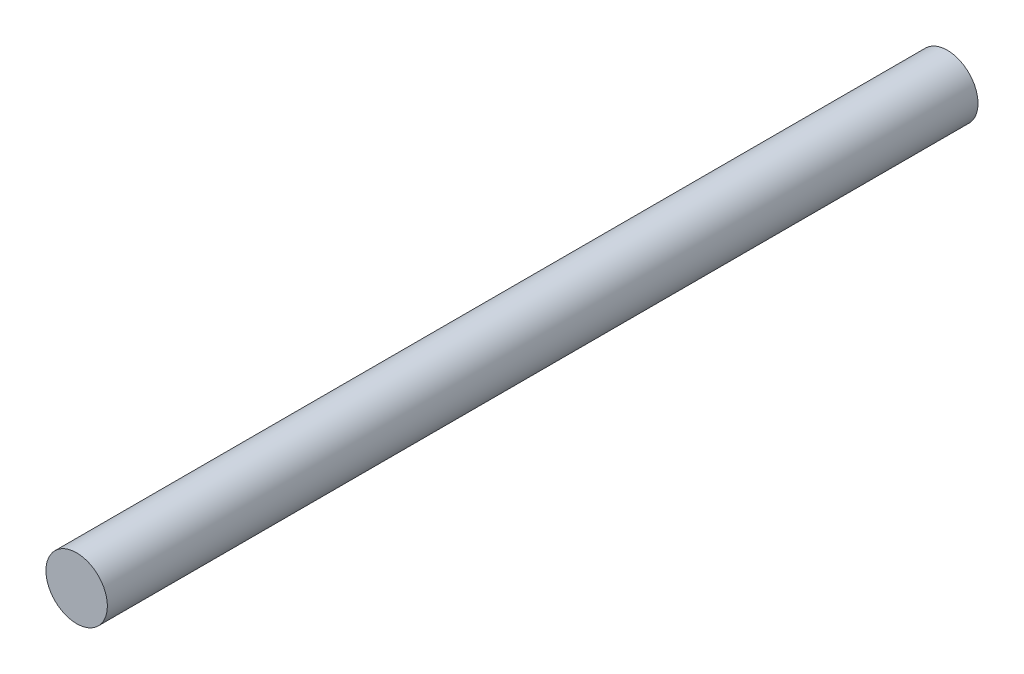
ISO-10303-21;
HEADER;
FILE_DESCRIPTION(('STEP AP214'),'2;1');
FILE_NAME('part.step','',(''),(''),'','','');
FILE_SCHEMA(('AUTOMOTIVE_DESIGN { 1 0 10303 214 1 1 1 1 }'));
ENDSEC;
DATA;
#1=APPLICATION_CONTEXT('core data for automotive mechanical design processes');
#2=APPLICATION_PROTOCOL_DEFINITION('international standard','automotive_design',2000,#1);
#3=PRODUCT_CONTEXT('',#1,'mechanical');
#4=PRODUCT('Part','Part','',(#3));
#5=PRODUCT_RELATED_PRODUCT_CATEGORY('part','',(#4));
#6=PRODUCT_DEFINITION_FORMATION('','',#4);
#7=PRODUCT_DEFINITION_CONTEXT('part definition',#1,'design');
#8=PRODUCT_DEFINITION('design','',#6,#7);
#9=PRODUCT_DEFINITION_SHAPE('','',#8);
#10=(LENGTH_UNIT() NAMED_UNIT(*) SI_UNIT(.MILLI.,.METRE.));
#11=(NAMED_UNIT(*) PLANE_ANGLE_UNIT() SI_UNIT($,.RADIAN.));
#12=(NAMED_UNIT(*) SI_UNIT($,.STERADIAN.) SOLID_ANGLE_UNIT());
#13=UNCERTAINTY_MEASURE_WITH_UNIT(LENGTH_MEASURE(1.E-05),#10,'distance_accuracy_value','');
#14=(GEOMETRIC_REPRESENTATION_CONTEXT(3) GLOBAL_UNCERTAINTY_ASSIGNED_CONTEXT((#13)) GLOBAL_UNIT_ASSIGNED_CONTEXT((#10,
#11,#12)) REPRESENTATION_CONTEXT('',''));
#15=CARTESIAN_POINT('',(0.,0.,0.));
#16=DIRECTION('',(0.,0.,1.));
#17=DIRECTION('',(1.,0.,0.));
#18=AXIS2_PLACEMENT_3D('',#15,#16,#17);
#19=CARTESIAN_POINT('',(0.,0.,-180.));
#20=DIRECTION('',(0.,0.,1.));
#21=DIRECTION('',(1.,0.,0.));
#22=AXIS2_PLACEMENT_3D('',#19,#20,#21);
#23=CYLINDRICAL_SURFACE('',#22,6.35);
#24=CARTESIAN_POINT('',(0.,0.,-180.));
#25=DIRECTION('',(0.,0.,1.));
#26=DIRECTION('',(1.,0.,0.));
#27=AXIS2_PLACEMENT_3D('',#24,#25,#26);
#28=CIRCLE('',#27,6.35);
#29=CARTESIAN_POINT('',(6.35,0.,-180.));
#30=VERTEX_POINT('',#29);
#31=EDGE_CURVE('E10',#30,#30,#28,.T.);
#32=ORIENTED_EDGE('',*,*,#31,.T.);
#33=EDGE_LOOP('',(#32));
#34=FACE_BOUND('',#33,.T.);
#35=CARTESIAN_POINT('',(0.,0.,0.));
#36=DIRECTION('',(0.,0.,1.));
#37=DIRECTION('',(1.,0.,0.));
#38=AXIS2_PLACEMENT_3D('',#35,#36,#37);
#39=CIRCLE('',#38,6.35);
#40=CARTESIAN_POINT('',(6.35,0.,0.));
#41=VERTEX_POINT('',#40);
#42=EDGE_CURVE('E34',#41,#41,#39,.T.);
#43=ORIENTED_EDGE('',*,*,#42,.F.);
#44=EDGE_LOOP('',(#43));
#45=FACE_BOUND('',#44,.T.);
#46=ADVANCED_FACE('F31',(#34,#45),#23,.T.);
#47=CARTESIAN_POINT('',(0.,0.,-180.));
#48=DIRECTION('',(0.,0.,1.));
#49=DIRECTION('',(1.,0.,0.));
#50=AXIS2_PLACEMENT_3D('',#47,#48,#49);
#51=PLANE('',#50);
#52=ORIENTED_EDGE('',*,*,#31,.F.);
#53=EDGE_LOOP('',(#52));
#54=FACE_BOUND('',#53,.T.);
#55=ADVANCED_FACE('F46',(#54),#51,.F.);
#56=CARTESIAN_POINT('',(0.,0.,0.));
#57=DIRECTION('',(0.,0.,1.));
#58=DIRECTION('',(1.,0.,0.));
#59=AXIS2_PLACEMENT_3D('',#56,#57,#58);
#60=PLANE('',#59);
#61=ORIENTED_EDGE('',*,*,#42,.T.);
#62=EDGE_LOOP('',(#61));
#63=FACE_BOUND('',#62,.T.);
#64=ADVANCED_FACE('F43',(#63),#60,.T.);
#65=CLOSED_SHELL('',(#46,#55,#64));
#66=MANIFOLD_SOLID_BREP('B2',#65);
#67=ADVANCED_BREP_SHAPE_REPRESENTATION('',(#18,#66),#14);
#68=SHAPE_DEFINITION_REPRESENTATION(#9,#67);
ENDSEC;
END-ISO-10303-21;
